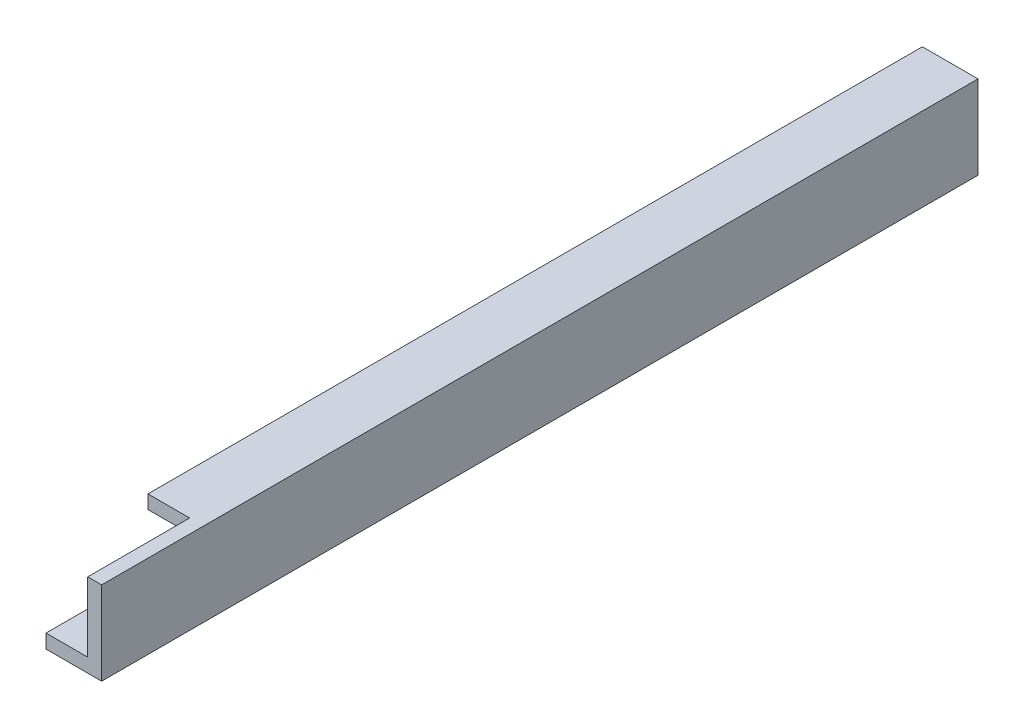
ISO-10303-21;
HEADER;
FILE_DESCRIPTION(('STEP AP214'),'2;1');
FILE_NAME('part.step','',(''),(''),'','','');
FILE_SCHEMA(('AUTOMOTIVE_DESIGN { 1 0 10303 214 1 1 1 1 }'));
ENDSEC;
DATA;
#1=APPLICATION_CONTEXT('core data for automotive mechanical design processes');
#2=APPLICATION_PROTOCOL_DEFINITION('international standard','automotive_design',2000,#1);
#3=PRODUCT_CONTEXT('',#1,'mechanical');
#4=PRODUCT('Part','Part','',(#3));
#5=PRODUCT_RELATED_PRODUCT_CATEGORY('part','',(#4));
#6=PRODUCT_DEFINITION_FORMATION('','',#4);
#7=PRODUCT_DEFINITION_CONTEXT('part definition',#1,'design');
#8=PRODUCT_DEFINITION('design','',#6,#7);
#9=PRODUCT_DEFINITION_SHAPE('','',#8);
#10=(LENGTH_UNIT() NAMED_UNIT(*) SI_UNIT(.MILLI.,.METRE.));
#11=(NAMED_UNIT(*) PLANE_ANGLE_UNIT() SI_UNIT($,.RADIAN.));
#12=(NAMED_UNIT(*) SI_UNIT($,.STERADIAN.) SOLID_ANGLE_UNIT());
#13=UNCERTAINTY_MEASURE_WITH_UNIT(LENGTH_MEASURE(1.E-05),#10,'distance_accuracy_value','');
#14=(GEOMETRIC_REPRESENTATION_CONTEXT(3) GLOBAL_UNCERTAINTY_ASSIGNED_CONTEXT((#13)) GLOBAL_UNIT_ASSIGNED_CONTEXT((#10,
#11,#12)) REPRESENTATION_CONTEXT('',''));
#15=CARTESIAN_POINT('',(0.,0.,0.));
#16=DIRECTION('',(0.,0.,1.));
#17=DIRECTION('',(1.,0.,0.));
#18=AXIS2_PLACEMENT_3D('',#15,#16,#17);
#19=CARTESIAN_POINT('',(19.05,38.1,-400.05));
#20=DIRECTION('',(1.,0.,0.));
#21=DIRECTION('',(0.,0.,-1.));
#22=AXIS2_PLACEMENT_3D('',#19,#20,#21);
#23=PLANE('',#22);
#24=DIRECTION('',(0.,0.,1.));
#25=VECTOR('',#24,1.);
#26=CARTESIAN_POINT('',(19.05,31.8981164511158,-400.05));
#27=LINE('',#26,#25);
#28=CARTESIAN_POINT('',(19.05,31.8981164511158,-393.7));
#29=VERTEX_POINT('',#28);
#30=CARTESIAN_POINT('',(19.05,31.8981164511158,-46.5317406324477));
#31=VERTEX_POINT('',#30);
#32=EDGE_CURVE('E167',#29,#31,#27,.T.);
#33=ORIENTED_EDGE('',*,*,#32,.F.);
#34=DIRECTION('',(0.,1.,0.));
#35=VECTOR('',#34,1.);
#36=CARTESIAN_POINT('',(19.05,6.49811645111585,-393.7));
#37=LINE('',#36,#35);
#38=CARTESIAN_POINT('',(19.05,6.49811645111585,-393.7));
#39=VERTEX_POINT('',#38);
#40=EDGE_CURVE('E239',#39,#29,#37,.T.);
#41=ORIENTED_EDGE('',*,*,#40,.F.);
#42=DIRECTION('',(0.,0.,1.));
#43=VECTOR('',#42,1.);
#44=CARTESIAN_POINT('',(19.05,6.49811645111585,-393.7));
#45=LINE('',#44,#43);
#46=CARTESIAN_POINT('',(19.05,6.49811645111584,-400.05));
#47=VERTEX_POINT('',#46);
#48=EDGE_CURVE('E243',#47,#39,#45,.T.);
#49=ORIENTED_EDGE('',*,*,#48,.F.);
#50=DIRECTION('',(0.,-1.,0.));
#51=VECTOR('',#50,1.);
#52=CARTESIAN_POINT('',(19.05,38.1,-400.05));
#53=LINE('',#52,#51);
#54=CARTESIAN_POINT('',(19.05,6.35,-400.05));
#55=VERTEX_POINT('',#54);
#56=EDGE_CURVE('E283',#47,#55,#53,.T.);
#57=ORIENTED_EDGE('',*,*,#56,.T.);
#58=DIRECTION('',(0.,0.,1.));
#59=VECTOR('',#58,1.);
#60=CARTESIAN_POINT('',(19.05,6.35,-400.05));
#61=LINE('',#60,#59);
#62=CARTESIAN_POINT('',(19.05,6.35,-266.7));
#63=VERTEX_POINT('',#62);
#64=EDGE_CURVE('E271',#55,#63,#61,.T.);
#65=ORIENTED_EDGE('',*,*,#64,.T.);
#66=DIRECTION('',(0.,-1.,0.));
#67=VECTOR('',#66,1.);
#68=CARTESIAN_POINT('',(19.05,6.35,-266.7));
#69=LINE('',#68,#67);
#70=CARTESIAN_POINT('',(19.05,31.75,-266.7));
#71=VERTEX_POINT('',#70);
#72=EDGE_CURVE('E64',#71,#63,#69,.T.);
#73=ORIENTED_EDGE('',*,*,#72,.F.);
#74=DIRECTION('',(0.,0.,-1.));
#75=VECTOR('',#74,1.);
#76=CARTESIAN_POINT('',(19.05,31.75,-260.35));
#77=LINE('',#76,#75);
#78=CARTESIAN_POINT('',(19.05,31.75,-260.35));
#79=VERTEX_POINT('',#78);
#80=EDGE_CURVE('E59',#79,#71,#77,.T.);
#81=ORIENTED_EDGE('',*,*,#80,.F.);
#82=DIRECTION('',(0.,1.,0.));
#83=VECTOR('',#82,1.);
#84=CARTESIAN_POINT('',(19.05,6.35,-260.35));
#85=LINE('',#84,#83);
#86=CARTESIAN_POINT('',(19.05,6.35,-260.35));
#87=VERTEX_POINT('',#86);
#88=EDGE_CURVE('E210',#87,#79,#85,.T.);
#89=ORIENTED_EDGE('',*,*,#88,.F.);
#90=CARTESIAN_POINT('',(19.05,6.35,0.));
#91=VERTEX_POINT('',#90);
#92=EDGE_CURVE('E265',#87,#91,#61,.T.);
#93=ORIENTED_EDGE('',*,*,#92,.T.);
#94=DIRECTION('',(0.,-1.,0.));
#95=VECTOR('',#94,1.);
#96=CARTESIAN_POINT('',(19.05,38.1,0.));
#97=LINE('',#96,#95);
#98=CARTESIAN_POINT('',(19.05,38.1,0.));
#99=VERTEX_POINT('',#98);
#100=EDGE_CURVE('E288',#99,#91,#97,.T.);
#101=ORIENTED_EDGE('',*,*,#100,.F.);
#102=DIRECTION('',(0.,0.,1.));
#103=VECTOR('',#102,1.);
#104=CARTESIAN_POINT('',(19.05,38.1,-400.05));
#105=LINE('',#104,#103);
#106=CARTESIAN_POINT('',(19.05,38.1,-46.5317406324477));
#107=VERTEX_POINT('',#106);
#108=EDGE_CURVE('E266',#107,#99,#105,.T.);
#109=ORIENTED_EDGE('',*,*,#108,.F.);
#110=DIRECTION('',(0.,1.,0.));
#111=VECTOR('',#110,1.);
#112=CARTESIAN_POINT('',(19.05,31.8981164511158,-46.5317406324477));
#113=LINE('',#112,#111);
#114=EDGE_CURVE('E161',#31,#107,#113,.T.);
#115=ORIENTED_EDGE('',*,*,#114,.F.);
#116=EDGE_LOOP('',(#33,#41,#49,#57,#65,#73,#81,#89,#93,#101,#109,#115));
#117=FACE_BOUND('',#116,.T.);
#118=ADVANCED_FACE('F42',(#117),#23,.F.);
#119=CARTESIAN_POINT('',(0.,6.35,0.));
#120=DIRECTION('',(0.,-1.,0.));
#121=DIRECTION('',(0.,0.,-1.));
#122=AXIS2_PLACEMENT_3D('',#119,#120,#121);
#123=PLANE('',#122);
#124=DIRECTION('',(1.,0.,0.));
#125=VECTOR('',#124,1.);
#126=CARTESIAN_POINT('',(0.,6.35,-260.35));
#127=LINE('',#126,#125);
#128=CARTESIAN_POINT('',(0.,6.35,-260.35));
#129=VERTEX_POINT('',#128);
#130=EDGE_CURVE('E209',#129,#87,#127,.T.);
#131=ORIENTED_EDGE('',*,*,#130,.F.);
#132=DIRECTION('',(0.,0.,1.));
#133=VECTOR('',#132,1.);
#134=CARTESIAN_POINT('',(0.,6.35,0.));
#135=LINE('',#134,#133);
#136=CARTESIAN_POINT('',(0.,6.35,0.));
#137=VERTEX_POINT('',#136);
#138=EDGE_CURVE('E297',#129,#137,#135,.T.);
#139=ORIENTED_EDGE('',*,*,#138,.T.);
#140=DIRECTION('',(1.,0.,0.));
#141=VECTOR('',#140,1.);
#142=CARTESIAN_POINT('',(0.,6.35,0.));
#143=LINE('',#142,#141);
#144=EDGE_CURVE('E296',#137,#91,#143,.T.);
#145=ORIENTED_EDGE('',*,*,#144,.T.);
#146=ORIENTED_EDGE('',*,*,#92,.F.);
#147=EDGE_LOOP('',(#131,#139,#145,#146));
#148=FACE_BOUND('',#147,.T.);
#149=ADVANCED_FACE('F366',(#148),#123,.F.);
#150=DIRECTION('',(1.,0.,0.));
#151=VECTOR('',#150,1.);
#152=CARTESIAN_POINT('',(0.,6.35,-266.7));
#153=LINE('',#152,#151);
#154=CARTESIAN_POINT('',(0.,6.35,-266.7));
#155=VERTEX_POINT('',#154);
#156=EDGE_CURVE('E221',#155,#63,#153,.T.);
#157=ORIENTED_EDGE('',*,*,#156,.T.);
#158=ORIENTED_EDGE('',*,*,#64,.F.);
#159=DIRECTION('',(-1.,0.,0.));
#160=VECTOR('',#159,1.);
#161=CARTESIAN_POINT('',(0.,6.35,-400.05));
#162=LINE('',#161,#160);
#163=CARTESIAN_POINT('',(0.,6.35,-400.05));
#164=VERTEX_POINT('',#163);
#165=EDGE_CURVE('E301',#55,#164,#162,.T.);
#166=ORIENTED_EDGE('',*,*,#165,.T.);
#167=EDGE_CURVE('E293',#164,#155,#135,.T.);
#168=ORIENTED_EDGE('',*,*,#167,.T.);
#169=EDGE_LOOP('',(#157,#158,#166,#168));
#170=FACE_BOUND('',#169,.T.);
#171=ADVANCED_FACE('F347',(#170),#123,.F.);
#172=CARTESIAN_POINT('',(0.,6.35,0.));
#173=DIRECTION('',(1.,0.,0.));
#174=DIRECTION('',(0.,0.,-1.));
#175=AXIS2_PLACEMENT_3D('',#172,#173,#174);
#176=PLANE('',#175);
#177=DIRECTION('',(0.,0.,1.));
#178=VECTOR('',#177,1.);
#179=CARTESIAN_POINT('',(0.,0.,0.));
#180=LINE('',#179,#178);
#181=CARTESIAN_POINT('',(0.,0.,-400.05));
#182=VERTEX_POINT('',#181);
#183=CARTESIAN_POINT('',(0.,0.,0.));
#184=VERTEX_POINT('',#183);
#185=EDGE_CURVE('E292',#182,#184,#180,.T.);
#186=ORIENTED_EDGE('',*,*,#185,.T.);
#187=DIRECTION('',(0.,-1.,0.));
#188=VECTOR('',#187,1.);
#189=CARTESIAN_POINT('',(0.,6.35,0.));
#190=LINE('',#189,#188);
#191=EDGE_CURVE('E12',#137,#184,#190,.T.);
#192=ORIENTED_EDGE('',*,*,#191,.F.);
#193=ORIENTED_EDGE('',*,*,#138,.F.);
#194=DIRECTION('',(0.,1.,0.));
#195=VECTOR('',#194,1.);
#196=CARTESIAN_POINT('',(0.,6.35,-260.35));
#197=LINE('',#196,#195);
#198=CARTESIAN_POINT('',(0.,31.75,-260.35));
#199=VERTEX_POINT('',#198);
#200=EDGE_CURVE('E198',#129,#199,#197,.T.);
#201=ORIENTED_EDGE('',*,*,#200,.T.);
#202=DIRECTION('',(0.,0.,-1.));
#203=VECTOR('',#202,1.);
#204=CARTESIAN_POINT('',(0.,31.75,-260.35));
#205=LINE('',#204,#203);
#206=CARTESIAN_POINT('',(0.,31.75,-266.7));
#207=VERTEX_POINT('',#206);
#208=EDGE_CURVE('E202',#199,#207,#205,.T.);
#209=ORIENTED_EDGE('',*,*,#208,.T.);
#210=DIRECTION('',(0.,-1.,0.));
#211=VECTOR('',#210,1.);
#212=CARTESIAN_POINT('',(0.,6.35,-266.7));
#213=LINE('',#212,#211);
#214=EDGE_CURVE('E205',#207,#155,#213,.T.);
#215=ORIENTED_EDGE('',*,*,#214,.T.);
#216=ORIENTED_EDGE('',*,*,#167,.F.);
#217=DIRECTION('',(0.,-1.,0.));
#218=VECTOR('',#217,1.);
#219=CARTESIAN_POINT('',(0.,6.35,-400.05));
#220=LINE('',#219,#218);
#221=EDGE_CURVE('E304',#164,#182,#220,.T.);
#222=ORIENTED_EDGE('',*,*,#221,.T.);
#223=EDGE_LOOP('',(#186,#192,#193,#201,#209,#215,#216,#222));
#224=FACE_BOUND('',#223,.T.);
#225=ADVANCED_FACE('F44',(#224),#176,.F.);
#226=CARTESIAN_POINT('',(0.,6.35,0.));
#227=DIRECTION('',(0.,0.,-1.));
#228=DIRECTION('',(-1.,0.,0.));
#229=AXIS2_PLACEMENT_3D('',#226,#227,#228);
#230=PLANE('',#229);
#231=DIRECTION('',(1.,0.,0.));
#232=VECTOR('',#231,1.);
#233=CARTESIAN_POINT('',(0.,0.,0.));
#234=LINE('',#233,#232);
#235=CARTESIAN_POINT('',(25.4,0.,0.));
#236=VERTEX_POINT('',#235);
#237=EDGE_CURVE('E308',#184,#236,#234,.T.);
#238=ORIENTED_EDGE('',*,*,#237,.T.);
#239=DIRECTION('',(0.,-1.,0.));
#240=VECTOR('',#239,1.);
#241=CARTESIAN_POINT('',(25.4,6.35,0.));
#242=LINE('',#241,#240);
#243=CARTESIAN_POINT('',(25.4,38.1,0.));
#244=VERTEX_POINT('',#243);
#245=EDGE_CURVE('E52',#244,#236,#242,.T.);
#246=ORIENTED_EDGE('',*,*,#245,.F.);
#247=DIRECTION('',(1.,0.,0.));
#248=VECTOR('',#247,1.);
#249=CARTESIAN_POINT('',(19.05,38.1,0.));
#250=LINE('',#249,#248);
#251=EDGE_CURVE('E270',#99,#244,#250,.T.);
#252=ORIENTED_EDGE('',*,*,#251,.F.);
#253=ORIENTED_EDGE('',*,*,#100,.T.);
#254=ORIENTED_EDGE('',*,*,#144,.F.);
#255=ORIENTED_EDGE('',*,*,#191,.T.);
#256=EDGE_LOOP('',(#238,#246,#252,#253,#254,#255));
#257=FACE_BOUND('',#256,.T.);
#258=ADVANCED_FACE('F360',(#257),#230,.F.);
#259=CARTESIAN_POINT('',(25.4,6.35,0.));
#260=DIRECTION('',(-1.,0.,0.));
#261=DIRECTION('',(0.,0.,1.));
#262=AXIS2_PLACEMENT_3D('',#259,#260,#261);
#263=PLANE('',#262);
#264=DIRECTION('',(0.,0.,-1.));
#265=VECTOR('',#264,1.);
#266=CARTESIAN_POINT('',(25.4,0.,0.));
#267=LINE('',#266,#265);
#268=CARTESIAN_POINT('',(25.4,0.,-400.05));
#269=VERTEX_POINT('',#268);
#270=EDGE_CURVE('E311',#236,#269,#267,.T.);
#271=ORIENTED_EDGE('',*,*,#270,.T.);
#272=DIRECTION('',(0.,-1.,0.));
#273=VECTOR('',#272,1.);
#274=CARTESIAN_POINT('',(25.4,6.35,-400.05));
#275=LINE('',#274,#273);
#276=CARTESIAN_POINT('',(25.4,38.1,-400.05));
#277=VERTEX_POINT('',#276);
#278=EDGE_CURVE('E320',#277,#269,#275,.T.);
#279=ORIENTED_EDGE('',*,*,#278,.F.);
#280=DIRECTION('',(0.,0.,-1.));
#281=VECTOR('',#280,1.);
#282=CARTESIAN_POINT('',(25.4,38.1,-400.05));
#283=LINE('',#282,#281);
#284=EDGE_CURVE('E275',#244,#277,#283,.T.);
#285=ORIENTED_EDGE('',*,*,#284,.F.);
#286=ORIENTED_EDGE('',*,*,#245,.T.);
#287=EDGE_LOOP('',(#271,#279,#285,#286));
#288=FACE_BOUND('',#287,.T.);
#289=ADVANCED_FACE('F329',(#288),#263,.F.);
#290=CARTESIAN_POINT('',(0.,6.35,-400.05));
#291=DIRECTION('',(0.,0.,1.));
#292=DIRECTION('',(1.,0.,0.));
#293=AXIS2_PLACEMENT_3D('',#290,#291,#292);
#294=PLANE('',#293);
#295=CARTESIAN_POINT('',(12.7,19.1981164511158,-400.05));
#296=DIRECTION('',(0.,0.,1.));
#297=DIRECTION('',(1.,0.,0.));
#298=AXIS2_PLACEMENT_3D('',#295,#296,#297);
#299=CIRCLE('',#298,4.572);
#300=CARTESIAN_POINT('',(17.272,19.1981164511158,-400.05));
#301=VERTEX_POINT('',#300);
#302=EDGE_CURVE('E235',#301,#301,#299,.T.);
#303=ORIENTED_EDGE('',*,*,#302,.T.);
#304=EDGE_LOOP('',(#303));
#305=FACE_BOUND('',#304,.T.);
#306=DIRECTION('',(-1.,0.,0.));
#307=VECTOR('',#306,1.);
#308=CARTESIAN_POINT('',(0.,0.,-400.05));
#309=LINE('',#308,#307);
#310=EDGE_CURVE('E314',#269,#182,#309,.T.);
#311=ORIENTED_EDGE('',*,*,#310,.T.);
#312=ORIENTED_EDGE('',*,*,#221,.F.);
#313=ORIENTED_EDGE('',*,*,#165,.F.);
#314=ORIENTED_EDGE('',*,*,#56,.F.);
#315=DIRECTION('',(1.,0.,0.));
#316=VECTOR('',#315,1.);
#317=CARTESIAN_POINT('',(0.,6.49811645111584,-400.05));
#318=LINE('',#317,#316);
#319=CARTESIAN_POINT('',(0.,6.49811645111584,-400.05));
#320=VERTEX_POINT('',#319);
#321=EDGE_CURVE('E259',#320,#47,#318,.T.);
#322=ORIENTED_EDGE('',*,*,#321,.F.);
#323=DIRECTION('',(0.,-1.,0.));
#324=VECTOR('',#323,1.);
#325=CARTESIAN_POINT('',(0.,6.49811645111584,-400.05));
#326=LINE('',#325,#324);
#327=CARTESIAN_POINT('',(0.,38.1,-400.05));
#328=VERTEX_POINT('',#327);
#329=EDGE_CURVE('E242',#328,#320,#326,.T.);
#330=ORIENTED_EDGE('',*,*,#329,.F.);
#331=DIRECTION('',(-1.,0.,0.));
#332=VECTOR('',#331,1.);
#333=CARTESIAN_POINT('',(19.05,38.1,-400.05));
#334=LINE('',#333,#332);
#335=EDGE_CURVE('E279',#277,#328,#334,.T.);
#336=ORIENTED_EDGE('',*,*,#335,.F.);
#337=ORIENTED_EDGE('',*,*,#278,.T.);
#338=EDGE_LOOP('',(#311,#312,#313,#314,#322,#330,#336,#337));
#339=FACE_BOUND('',#338,.T.);
#340=ADVANCED_FACE('F338',(#305,#339),#294,.F.);
#341=CARTESIAN_POINT('',(0.,0.,0.));
#342=DIRECTION('',(0.,-1.,0.));
#343=DIRECTION('',(0.,0.,-1.));
#344=AXIS2_PLACEMENT_3D('',#341,#342,#343);
#345=PLANE('',#344);
#346=ORIENTED_EDGE('',*,*,#185,.F.);
#347=ORIENTED_EDGE('',*,*,#310,.F.);
#348=ORIENTED_EDGE('',*,*,#270,.F.);
#349=ORIENTED_EDGE('',*,*,#237,.F.);
#350=EDGE_LOOP('',(#346,#347,#348,#349));
#351=FACE_BOUND('',#350,.T.);
#352=ADVANCED_FACE('F335',(#351),#345,.T.);
#353=CARTESIAN_POINT('',(0.,38.1,0.));
#354=DIRECTION('',(0.,1.,0.));
#355=DIRECTION('',(0.,0.,1.));
#356=AXIS2_PLACEMENT_3D('',#353,#354,#355);
#357=PLANE('',#356);
#358=ORIENTED_EDGE('',*,*,#335,.T.);
#359=DIRECTION('',(0.,0.,-1.));
#360=VECTOR('',#359,1.);
#361=CARTESIAN_POINT('',(0.,38.1,-400.05));
#362=LINE('',#361,#360);
#363=CARTESIAN_POINT('',(0.,38.1,-46.5317406324477));
#364=VERTEX_POINT('',#363);
#365=EDGE_CURVE('E178',#364,#328,#362,.T.);
#366=ORIENTED_EDGE('',*,*,#365,.F.);
#367=DIRECTION('',(1.,0.,0.));
#368=VECTOR('',#367,1.);
#369=CARTESIAN_POINT('',(0.,38.1,-46.5317406324477));
#370=LINE('',#369,#368);
#371=EDGE_CURVE('E172',#364,#107,#370,.T.);
#372=ORIENTED_EDGE('',*,*,#371,.T.);
#373=ORIENTED_EDGE('',*,*,#108,.T.);
#374=ORIENTED_EDGE('',*,*,#251,.T.);
#375=ORIENTED_EDGE('',*,*,#284,.T.);
#376=EDGE_LOOP('',(#358,#366,#372,#373,#374,#375));
#377=FACE_BOUND('',#376,.T.);
#378=ADVANCED_FACE('F357',(#377),#357,.T.);
#379=CARTESIAN_POINT('',(0.,6.49811645111585,-393.7));
#380=DIRECTION('',(0.,0.,-1.));
#381=DIRECTION('',(-1.,0.,0.));
#382=AXIS2_PLACEMENT_3D('',#379,#380,#381);
#383=PLANE('',#382);
#384=CARTESIAN_POINT('',(12.7,19.1981164511158,-393.7));
#385=DIRECTION('',(0.,0.,1.));
#386=DIRECTION('',(1.,0.,0.));
#387=AXIS2_PLACEMENT_3D('',#384,#385,#386);
#388=CIRCLE('',#387,4.572);
#389=CARTESIAN_POINT('',(17.272,19.1981164511158,-393.7));
#390=VERTEX_POINT('',#389);
#391=EDGE_CURVE('E231',#390,#390,#388,.T.);
#392=ORIENTED_EDGE('',*,*,#391,.F.);
#393=EDGE_LOOP('',(#392));
#394=FACE_BOUND('',#393,.T.);
#395=ORIENTED_EDGE('',*,*,#40,.T.);
#396=DIRECTION('',(1.,0.,0.));
#397=VECTOR('',#396,1.);
#398=CARTESIAN_POINT('',(0.,31.8981164511158,-393.7));
#399=LINE('',#398,#397);
#400=CARTESIAN_POINT('',(0.,31.8981164511158,-393.7));
#401=VERTEX_POINT('',#400);
#402=EDGE_CURVE('E263',#401,#29,#399,.T.);
#403=ORIENTED_EDGE('',*,*,#402,.F.);
#404=DIRECTION('',(0.,1.,0.));
#405=VECTOR('',#404,1.);
#406=CARTESIAN_POINT('',(0.,6.49811645111585,-393.7));
#407=LINE('',#406,#405);
#408=CARTESIAN_POINT('',(0.,6.49811645111585,-393.7));
#409=VERTEX_POINT('',#408);
#410=EDGE_CURVE('E157',#409,#401,#407,.T.);
#411=ORIENTED_EDGE('',*,*,#410,.F.);
#412=DIRECTION('',(1.,0.,0.));
#413=VECTOR('',#412,1.);
#414=CARTESIAN_POINT('',(0.,6.49811645111585,-393.7));
#415=LINE('',#414,#413);
#416=EDGE_CURVE('E249',#409,#39,#415,.T.);
#417=ORIENTED_EDGE('',*,*,#416,.T.);
#418=EDGE_LOOP('',(#395,#403,#411,#417));
#419=FACE_BOUND('',#418,.T.);
#420=ADVANCED_FACE('F440',(#394,#419),#383,.F.);
#421=CARTESIAN_POINT('',(0.,6.49811645111585,-393.7));
#422=DIRECTION('',(0.,1.,0.));
#423=DIRECTION('',(0.,0.,1.));
#424=AXIS2_PLACEMENT_3D('',#421,#422,#423);
#425=PLANE('',#424);
#426=ORIENTED_EDGE('',*,*,#48,.T.);
#427=ORIENTED_EDGE('',*,*,#416,.F.);
#428=DIRECTION('',(0.,0.,1.));
#429=VECTOR('',#428,1.);
#430=CARTESIAN_POINT('',(0.,6.49811645111585,-393.7));
#431=LINE('',#430,#429);
#432=EDGE_CURVE('E246',#320,#409,#431,.T.);
#433=ORIENTED_EDGE('',*,*,#432,.F.);
#434=ORIENTED_EDGE('',*,*,#321,.T.);
#435=EDGE_LOOP('',(#426,#427,#433,#434));
#436=FACE_BOUND('',#435,.T.);
#437=ADVANCED_FACE('F354',(#436),#425,.F.);
#438=CARTESIAN_POINT('',(0.,0.,0.));
#439=DIRECTION('',(-1.,0.,0.));
#440=DIRECTION('',(0.,0.,1.));
#441=AXIS2_PLACEMENT_3D('',#438,#439,#440);
#442=PLANE('',#441);
#443=ORIENTED_EDGE('',*,*,#410,.T.);
#444=DIRECTION('',(0.,0.,1.));
#445=VECTOR('',#444,1.);
#446=CARTESIAN_POINT('',(0.,31.8981164511158,-400.05));
#447=LINE('',#446,#445);
#448=CARTESIAN_POINT('',(0.,31.8981164511158,-46.5317406324477));
#449=VERTEX_POINT('',#448);
#450=EDGE_CURVE('E149',#401,#449,#447,.T.);
#451=ORIENTED_EDGE('',*,*,#450,.T.);
#452=DIRECTION('',(0.,1.,0.));
#453=VECTOR('',#452,1.);
#454=CARTESIAN_POINT('',(0.,31.8981164511158,-46.5317406324477));
#455=LINE('',#454,#453);
#456=EDGE_CURVE('E154',#449,#364,#455,.T.);
#457=ORIENTED_EDGE('',*,*,#456,.T.);
#458=ORIENTED_EDGE('',*,*,#365,.T.);
#459=ORIENTED_EDGE('',*,*,#329,.T.);
#460=ORIENTED_EDGE('',*,*,#432,.T.);
#461=EDGE_LOOP('',(#443,#451,#457,#458,#459,#460));
#462=FACE_BOUND('',#461,.T.);
#463=ADVANCED_FACE('F151',(#462),#442,.T.);
#464=CARTESIAN_POINT('',(12.7,19.1981164511158,-412.75));
#465=DIRECTION('',(0.,0.,1.));
#466=DIRECTION('',(1.,0.,0.));
#467=AXIS2_PLACEMENT_3D('',#464,#465,#466);
#468=CYLINDRICAL_SURFACE('',#467,4.572);
#469=ORIENTED_EDGE('',*,*,#391,.T.);
#470=EDGE_LOOP('',(#469));
#471=FACE_BOUND('',#470,.T.);
#472=ORIENTED_EDGE('',*,*,#302,.F.);
#473=EDGE_LOOP('',(#472));
#474=FACE_BOUND('',#473,.T.);
#475=ADVANCED_FACE('F423',(#471,#474),#468,.F.);
#476=CARTESIAN_POINT('',(0.,6.35,-260.35));
#477=DIRECTION('',(0.,0.,-1.));
#478=DIRECTION('',(-1.,0.,0.));
#479=AXIS2_PLACEMENT_3D('',#476,#477,#478);
#480=PLANE('',#479);
#481=CARTESIAN_POINT('',(12.7,19.05,-260.35));
#482=DIRECTION('',(0.,0.,1.));
#483=DIRECTION('',(1.,0.,0.));
#484=AXIS2_PLACEMENT_3D('',#481,#482,#483);
#485=CIRCLE('',#484,4.572);
#486=CARTESIAN_POINT('',(17.272,19.05,-260.35));
#487=VERTEX_POINT('',#486);
#488=EDGE_CURVE('E171',#487,#487,#485,.T.);
#489=ORIENTED_EDGE('',*,*,#488,.F.);
#490=EDGE_LOOP('',(#489));
#491=FACE_BOUND('',#490,.T.);
#492=ORIENTED_EDGE('',*,*,#88,.T.);
#493=DIRECTION('',(1.,0.,0.));
#494=VECTOR('',#493,1.);
#495=CARTESIAN_POINT('',(0.,31.75,-260.35));
#496=LINE('',#495,#494);
#497=EDGE_CURVE('E228',#199,#79,#496,.T.);
#498=ORIENTED_EDGE('',*,*,#497,.F.);
#499=ORIENTED_EDGE('',*,*,#200,.F.);
#500=ORIENTED_EDGE('',*,*,#130,.T.);
#501=EDGE_LOOP('',(#492,#498,#499,#500));
#502=FACE_BOUND('',#501,.T.);
#503=ADVANCED_FACE('F371',(#491,#502),#480,.F.);
#504=CARTESIAN_POINT('',(0.,31.75,-260.35));
#505=DIRECTION('',(0.,-1.,0.));
#506=DIRECTION('',(0.,0.,-1.));
#507=AXIS2_PLACEMENT_3D('',#504,#505,#506);
#508=PLANE('',#507);
#509=ORIENTED_EDGE('',*,*,#80,.T.);
#510=DIRECTION('',(1.,0.,0.));
#511=VECTOR('',#510,1.);
#512=CARTESIAN_POINT('',(0.,31.75,-266.7));
#513=LINE('',#512,#511);
#514=EDGE_CURVE('E224',#207,#71,#513,.T.);
#515=ORIENTED_EDGE('',*,*,#514,.F.);
#516=ORIENTED_EDGE('',*,*,#208,.F.);
#517=ORIENTED_EDGE('',*,*,#497,.T.);
#518=EDGE_LOOP('',(#509,#515,#516,#517));
#519=FACE_BOUND('',#518,.T.);
#520=ADVANCED_FACE('F373',(#519),#508,.F.);
#521=CARTESIAN_POINT('',(0.,6.35,-266.7));
#522=DIRECTION('',(0.,0.,1.));
#523=DIRECTION('',(1.,0.,0.));
#524=AXIS2_PLACEMENT_3D('',#521,#522,#523);
#525=PLANE('',#524);
#526=CARTESIAN_POINT('',(12.7,19.05,-266.7));
#527=DIRECTION('',(0.,0.,1.));
#528=DIRECTION('',(1.,0.,0.));
#529=AXIS2_PLACEMENT_3D('',#526,#527,#528);
#530=CIRCLE('',#529,4.572);
#531=CARTESIAN_POINT('',(17.272,19.05,-266.7));
#532=VERTEX_POINT('',#531);
#533=EDGE_CURVE('E46',#532,#532,#530,.T.);
#534=ORIENTED_EDGE('',*,*,#533,.T.);
#535=EDGE_LOOP('',(#534));
#536=FACE_BOUND('',#535,.T.);
#537=ORIENTED_EDGE('',*,*,#72,.T.);
#538=ORIENTED_EDGE('',*,*,#156,.F.);
#539=ORIENTED_EDGE('',*,*,#214,.F.);
#540=ORIENTED_EDGE('',*,*,#514,.T.);
#541=EDGE_LOOP('',(#537,#538,#539,#540));
#542=FACE_BOUND('',#541,.T.);
#543=ADVANCED_FACE('F376',(#536,#542),#525,.F.);
#544=CARTESIAN_POINT('',(12.7,19.05,-279.4));
#545=DIRECTION('',(0.,0.,1.));
#546=DIRECTION('',(1.,0.,0.));
#547=AXIS2_PLACEMENT_3D('',#544,#545,#546);
#548=CYLINDRICAL_SURFACE('',#547,4.572);
#549=ORIENTED_EDGE('',*,*,#488,.T.);
#550=EDGE_LOOP('',(#549));
#551=FACE_BOUND('',#550,.T.);
#552=ORIENTED_EDGE('',*,*,#533,.F.);
#553=EDGE_LOOP('',(#552));
#554=FACE_BOUND('',#553,.T.);
#555=ADVANCED_FACE('F378',(#551,#554),#548,.F.);
#556=CARTESIAN_POINT('',(0.,31.8981164511158,-400.05));
#557=DIRECTION('',(0.,1.,0.));
#558=DIRECTION('',(0.,0.,1.));
#559=AXIS2_PLACEMENT_3D('',#556,#557,#558);
#560=PLANE('',#559);
#561=ORIENTED_EDGE('',*,*,#450,.F.);
#562=ORIENTED_EDGE('',*,*,#402,.T.);
#563=ORIENTED_EDGE('',*,*,#32,.T.);
#564=DIRECTION('',(1.,0.,0.));
#565=VECTOR('',#564,1.);
#566=CARTESIAN_POINT('',(0.,31.8981164511158,-46.5317406324477));
#567=LINE('',#566,#565);
#568=EDGE_CURVE('E164',#449,#31,#567,.T.);
#569=ORIENTED_EDGE('',*,*,#568,.F.);
#570=EDGE_LOOP('',(#561,#562,#563,#569));
#571=FACE_BOUND('',#570,.T.);
#572=ADVANCED_FACE('F165',(#571),#560,.F.);
#573=CARTESIAN_POINT('',(0.,31.8981164511158,-46.5317406324477));
#574=DIRECTION('',(0.,0.,-1.));
#575=DIRECTION('',(-1.,0.,0.));
#576=AXIS2_PLACEMENT_3D('',#573,#574,#575);
#577=PLANE('',#576);
#578=ORIENTED_EDGE('',*,*,#114,.T.);
#579=ORIENTED_EDGE('',*,*,#371,.F.);
#580=ORIENTED_EDGE('',*,*,#456,.F.);
#581=ORIENTED_EDGE('',*,*,#568,.T.);
#582=EDGE_LOOP('',(#578,#579,#580,#581));
#583=FACE_BOUND('',#582,.T.);
#584=ADVANCED_FACE('F174',(#583),#577,.F.);
#585=CLOSED_SHELL('',(#118,#149,#171,#225,#258,#289,#340,#352,#378,#420,#437,#463,#475,#503,
#520,#543,#555,#572,#584));
#586=MANIFOLD_SOLID_BREP('B2',#585);
#587=ADVANCED_BREP_SHAPE_REPRESENTATION('',(#18,#586),#14);
#588=SHAPE_DEFINITION_REPRESENTATION(#9,#587);
ENDSEC;
END-ISO-10303-21;
